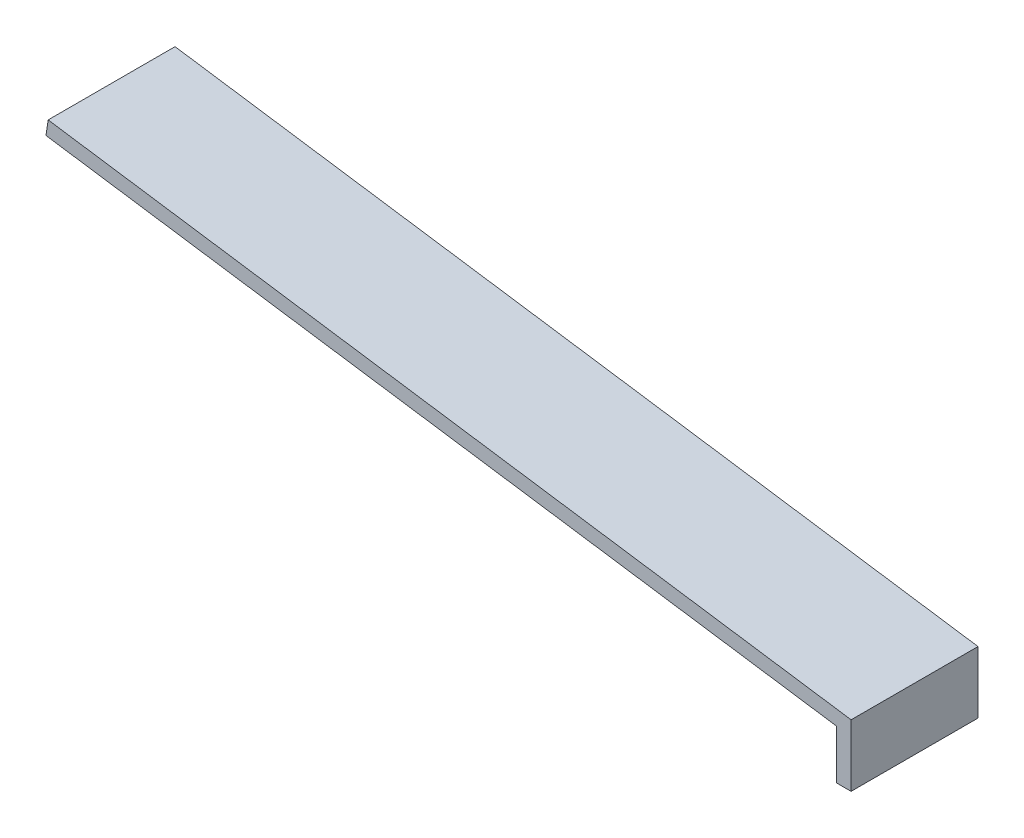
ISO-10303-21;
HEADER;
FILE_DESCRIPTION(('STEP AP214'),'2;1');
FILE_NAME('part.step','',(''),(''),'','','');
FILE_SCHEMA(('AUTOMOTIVE_DESIGN { 1 0 10303 214 1 1 1 1 }'));
ENDSEC;
DATA;
#1=APPLICATION_CONTEXT('core data for automotive mechanical design processes');
#2=APPLICATION_PROTOCOL_DEFINITION('international standard','automotive_design',2000,#1);
#3=PRODUCT_CONTEXT('',#1,'mechanical');
#4=PRODUCT('Part','Part','',(#3));
#5=PRODUCT_RELATED_PRODUCT_CATEGORY('part','',(#4));
#6=PRODUCT_DEFINITION_FORMATION('','',#4);
#7=PRODUCT_DEFINITION_CONTEXT('part definition',#1,'design');
#8=PRODUCT_DEFINITION('design','',#6,#7);
#9=PRODUCT_DEFINITION_SHAPE('','',#8);
#10=(LENGTH_UNIT() NAMED_UNIT(*) SI_UNIT(.MILLI.,.METRE.));
#11=(NAMED_UNIT(*) PLANE_ANGLE_UNIT() SI_UNIT($,.RADIAN.));
#12=(NAMED_UNIT(*) SI_UNIT($,.STERADIAN.) SOLID_ANGLE_UNIT());
#13=UNCERTAINTY_MEASURE_WITH_UNIT(LENGTH_MEASURE(1.E-05),#10,'distance_accuracy_value','');
#14=(GEOMETRIC_REPRESENTATION_CONTEXT(3) GLOBAL_UNCERTAINTY_ASSIGNED_CONTEXT((#13)) GLOBAL_UNIT_ASSIGNED_CONTEXT((#10,
#11,#12)) REPRESENTATION_CONTEXT('',''));
#15=CARTESIAN_POINT('',(0.,0.,0.));
#16=DIRECTION('',(0.,0.,1.));
#17=DIRECTION('',(1.,0.,0.));
#18=AXIS2_PLACEMENT_3D('',#15,#16,#17);
#19=CARTESIAN_POINT('',(0.5,0.,2.15));
#20=DIRECTION('',(-1.,0.,0.));
#21=DIRECTION('',(0.,-1.,0.));
#22=AXIS2_PLACEMENT_3D('',#19,#20,#21);
#23=PLANE('',#22);
#24=DIRECTION('',(0.,1.,0.));
#25=VECTOR('',#24,1.);
#26=CARTESIAN_POINT('',(0.5,0.,-2.15));
#27=LINE('',#26,#25);
#28=CARTESIAN_POINT('',(0.5,0.,-2.15));
#29=VERTEX_POINT('',#28);
#30=CARTESIAN_POINT('',(0.5,2.1,-2.15));
#31=VERTEX_POINT('',#30);
#32=EDGE_CURVE('E73',#29,#31,#27,.T.);
#33=ORIENTED_EDGE('',*,*,#32,.T.);
#34=DIRECTION('',(0.,0.,-1.));
#35=VECTOR('',#34,1.);
#36=CARTESIAN_POINT('',(0.5,2.1,2.15));
#37=LINE('',#36,#35);
#38=CARTESIAN_POINT('',(0.5,2.1,2.15));
#39=VERTEX_POINT('',#38);
#40=EDGE_CURVE('E11',#39,#31,#37,.T.);
#41=ORIENTED_EDGE('',*,*,#40,.F.);
#42=DIRECTION('',(0.,1.,0.));
#43=VECTOR('',#42,1.);
#44=CARTESIAN_POINT('',(0.5,0.,2.15));
#45=LINE('',#44,#43);
#46=CARTESIAN_POINT('',(0.5,0.,2.15));
#47=VERTEX_POINT('',#46);
#48=EDGE_CURVE('E96',#47,#39,#45,.T.);
#49=ORIENTED_EDGE('',*,*,#48,.F.);
#50=DIRECTION('',(0.,0.,-1.));
#51=VECTOR('',#50,1.);
#52=CARTESIAN_POINT('',(0.5,0.,2.15));
#53=LINE('',#52,#51);
#54=EDGE_CURVE('E86',#47,#29,#53,.T.);
#55=ORIENTED_EDGE('',*,*,#54,.T.);
#56=EDGE_LOOP('',(#33,#41,#49,#55));
#57=FACE_BOUND('',#56,.T.);
#58=ADVANCED_FACE('F17',(#57),#23,.F.);
#59=CARTESIAN_POINT('',(0.5,2.1,2.15));
#60=DIRECTION('',(-0.145454545454545,-0.989364935302748,0.));
#61=DIRECTION('',(0.989364935302748,-0.145454545454545,0.));
#62=AXIS2_PLACEMENT_3D('',#59,#60,#61);
#63=PLANE('',#62);
#64=DIRECTION('',(-0.989364935302748,0.145454545454545,0.));
#65=VECTOR('',#64,1.);
#66=CARTESIAN_POINT('',(0.5,2.1,-2.15));
#67=LINE('',#66,#65);
#68=CARTESIAN_POINT('',(-26.7075357208256,6.1,-2.15));
#69=VERTEX_POINT('',#68);
#70=EDGE_CURVE('E69',#31,#69,#67,.T.);
#71=ORIENTED_EDGE('',*,*,#70,.T.);
#72=DIRECTION('',(0.,0.,-1.));
#73=VECTOR('',#72,1.);
#74=CARTESIAN_POINT('',(-26.7075357208256,6.1,2.15));
#75=LINE('',#74,#73);
#76=CARTESIAN_POINT('',(-26.7075357208256,6.1,2.15));
#77=VERTEX_POINT('',#76);
#78=EDGE_CURVE('E24',#77,#69,#75,.T.);
#79=ORIENTED_EDGE('',*,*,#78,.F.);
#80=DIRECTION('',(-0.989364935302748,0.145454545454545,0.));
#81=VECTOR('',#80,1.);
#82=CARTESIAN_POINT('',(0.5,2.1,2.15));
#83=LINE('',#82,#81);
#84=EDGE_CURVE('E82',#39,#77,#83,.T.);
#85=ORIENTED_EDGE('',*,*,#84,.F.);
#86=ORIENTED_EDGE('',*,*,#40,.T.);
#87=EDGE_LOOP('',(#71,#79,#85,#86));
#88=FACE_BOUND('',#87,.T.);
#89=ADVANCED_FACE('F81',(#88),#63,.F.);
#90=CARTESIAN_POINT('',(-26.7075357208256,6.1,2.15));
#91=DIRECTION('',(0.989364935302748,-0.145454545454546,0.));
#92=DIRECTION('',(0.145454545454546,0.989364935302748,0.));
#93=AXIS2_PLACEMENT_3D('',#90,#91,#92);
#94=PLANE('',#93);
#95=DIRECTION('',(-0.145454545454546,-0.989364935302748,0.));
#96=VECTOR('',#95,1.);
#97=CARTESIAN_POINT('',(-26.7075357208256,6.1,-2.15));
#98=LINE('',#97,#96);
#99=CARTESIAN_POINT('',(-26.7802629935528,5.60531753234863,-2.15));
#100=VERTEX_POINT('',#99);
#101=EDGE_CURVE('E75',#69,#100,#98,.T.);
#102=ORIENTED_EDGE('',*,*,#101,.T.);
#103=DIRECTION('',(0.,0.,-1.));
#104=VECTOR('',#103,1.);
#105=CARTESIAN_POINT('',(-26.7802629935528,5.60531753234863,2.15));
#106=LINE('',#105,#104);
#107=CARTESIAN_POINT('',(-26.7802629935528,5.60531753234863,2.15));
#108=VERTEX_POINT('',#107);
#109=EDGE_CURVE('E112',#108,#100,#106,.T.);
#110=ORIENTED_EDGE('',*,*,#109,.F.);
#111=DIRECTION('',(-0.145454545454546,-0.989364935302748,0.));
#112=VECTOR('',#111,1.);
#113=CARTESIAN_POINT('',(-26.7075357208256,6.1,2.15));
#114=LINE('',#113,#112);
#115=EDGE_CURVE('E99',#77,#108,#114,.T.);
#116=ORIENTED_EDGE('',*,*,#115,.F.);
#117=ORIENTED_EDGE('',*,*,#78,.T.);
#118=EDGE_LOOP('',(#102,#110,#116,#117));
#119=FACE_BOUND('',#118,.T.);
#120=ADVANCED_FACE('F116',(#119),#94,.F.);
#121=CARTESIAN_POINT('',(-26.7802629935528,5.60531753234863,2.15));
#122=DIRECTION('',(0.145454545454545,0.989364935302748,0.));
#123=DIRECTION('',(-0.989364935302748,0.145454545454545,0.));
#124=AXIS2_PLACEMENT_3D('',#121,#122,#123);
#125=PLANE('',#124);
#126=DIRECTION('',(0.989364935302748,-0.145454545454545,0.));
#127=VECTOR('',#126,1.);
#128=CARTESIAN_POINT('',(-26.7802629935528,5.60531753234863,-2.15));
#129=LINE('',#128,#127);
#130=CARTESIAN_POINT('',(0.,1.66813435363769,-2.15));
#131=VERTEX_POINT('',#130);
#132=EDGE_CURVE('E90',#100,#131,#129,.T.);
#133=ORIENTED_EDGE('',*,*,#132,.T.);
#134=DIRECTION('',(0.,0.,-1.));
#135=VECTOR('',#134,1.);
#136=CARTESIAN_POINT('',(0.,1.66813435363769,2.15));
#137=LINE('',#136,#135);
#138=CARTESIAN_POINT('',(0.,1.66813435363769,2.15));
#139=VERTEX_POINT('',#138);
#140=EDGE_CURVE('E109',#139,#131,#137,.T.);
#141=ORIENTED_EDGE('',*,*,#140,.F.);
#142=DIRECTION('',(0.989364935302748,-0.145454545454545,0.));
#143=VECTOR('',#142,1.);
#144=CARTESIAN_POINT('',(-26.7802629935528,5.60531753234863,2.15));
#145=LINE('',#144,#143);
#146=EDGE_CURVE('E101',#108,#139,#145,.T.);
#147=ORIENTED_EDGE('',*,*,#146,.F.);
#148=ORIENTED_EDGE('',*,*,#109,.T.);
#149=EDGE_LOOP('',(#133,#141,#147,#148));
#150=FACE_BOUND('',#149,.T.);
#151=ADVANCED_FACE('F122',(#150),#125,.F.);
#152=CARTESIAN_POINT('',(0.,1.66813435363769,2.15));
#153=DIRECTION('',(1.,0.,0.));
#154=DIRECTION('',(0.,1.,0.));
#155=AXIS2_PLACEMENT_3D('',#152,#153,#154);
#156=PLANE('',#155);
#157=DIRECTION('',(0.,-1.,0.));
#158=VECTOR('',#157,1.);
#159=CARTESIAN_POINT('',(0.,1.66813435363769,-2.15));
#160=LINE('',#159,#158);
#161=CARTESIAN_POINT('',(0.,0.,-2.15));
#162=VERTEX_POINT('',#161);
#163=EDGE_CURVE('E92',#131,#162,#160,.T.);
#164=ORIENTED_EDGE('',*,*,#163,.T.);
#165=DIRECTION('',(0.,0.,-1.));
#166=VECTOR('',#165,1.);
#167=CARTESIAN_POINT('',(0.,0.,2.15));
#168=LINE('',#167,#166);
#169=CARTESIAN_POINT('',(0.,0.,2.15));
#170=VERTEX_POINT('',#169);
#171=EDGE_CURVE('E106',#170,#162,#168,.T.);
#172=ORIENTED_EDGE('',*,*,#171,.F.);
#173=DIRECTION('',(0.,-1.,0.));
#174=VECTOR('',#173,1.);
#175=CARTESIAN_POINT('',(0.,1.66813435363769,2.15));
#176=LINE('',#175,#174);
#177=EDGE_CURVE('E36',#139,#170,#176,.T.);
#178=ORIENTED_EDGE('',*,*,#177,.F.);
#179=ORIENTED_EDGE('',*,*,#140,.T.);
#180=EDGE_LOOP('',(#164,#172,#178,#179));
#181=FACE_BOUND('',#180,.T.);
#182=ADVANCED_FACE('F125',(#181),#156,.F.);
#183=CARTESIAN_POINT('',(0.,0.,2.15));
#184=DIRECTION('',(0.,1.,0.));
#185=DIRECTION('',(0.,0.,1.));
#186=AXIS2_PLACEMENT_3D('',#183,#184,#185);
#187=PLANE('',#186);
#188=DIRECTION('',(1.,0.,0.));
#189=VECTOR('',#188,1.);
#190=CARTESIAN_POINT('',(0.,0.,-2.15));
#191=LINE('',#190,#189);
#192=EDGE_CURVE('E94',#162,#29,#191,.T.);
#193=ORIENTED_EDGE('',*,*,#192,.T.);
#194=ORIENTED_EDGE('',*,*,#54,.F.);
#195=DIRECTION('',(1.,0.,0.));
#196=VECTOR('',#195,1.);
#197=CARTESIAN_POINT('',(0.,0.,2.15));
#198=LINE('',#197,#196);
#199=EDGE_CURVE('E31',#170,#47,#198,.T.);
#200=ORIENTED_EDGE('',*,*,#199,.F.);
#201=ORIENTED_EDGE('',*,*,#171,.T.);
#202=EDGE_LOOP('',(#193,#194,#200,#201));
#203=FACE_BOUND('',#202,.T.);
#204=ADVANCED_FACE('F127',(#203),#187,.F.);
#205=CARTESIAN_POINT('',(0.5,0.,2.15));
#206=DIRECTION('',(0.,0.,-1.));
#207=DIRECTION('',(-1.,0.,0.));
#208=AXIS2_PLACEMENT_3D('',#205,#206,#207);
#209=PLANE('',#208);
#210=ORIENTED_EDGE('',*,*,#48,.T.);
#211=ORIENTED_EDGE('',*,*,#84,.T.);
#212=ORIENTED_EDGE('',*,*,#115,.T.);
#213=ORIENTED_EDGE('',*,*,#146,.T.);
#214=ORIENTED_EDGE('',*,*,#177,.T.);
#215=ORIENTED_EDGE('',*,*,#199,.T.);
#216=EDGE_LOOP('',(#210,#211,#212,#213,#214,#215));
#217=FACE_BOUND('',#216,.T.);
#218=ADVANCED_FACE('F119',(#217),#209,.F.);
#219=CARTESIAN_POINT('',(0.5,0.,-2.15));
#220=DIRECTION('',(0.,0.,-1.));
#221=DIRECTION('',(-1.,0.,0.));
#222=AXIS2_PLACEMENT_3D('',#219,#220,#221);
#223=PLANE('',#222);
#224=ORIENTED_EDGE('',*,*,#32,.F.);
#225=ORIENTED_EDGE('',*,*,#192,.F.);
#226=ORIENTED_EDGE('',*,*,#163,.F.);
#227=ORIENTED_EDGE('',*,*,#132,.F.);
#228=ORIENTED_EDGE('',*,*,#101,.F.);
#229=ORIENTED_EDGE('',*,*,#70,.F.);
#230=EDGE_LOOP('',(#224,#225,#226,#227,#228,#229));
#231=FACE_BOUND('',#230,.T.);
#232=ADVANCED_FACE('F70',(#231),#223,.T.);
#233=CLOSED_SHELL('',(#58,#89,#120,#151,#182,#204,#218,#232));
#234=MANIFOLD_SOLID_BREP('B1',#233);
#235=ADVANCED_BREP_SHAPE_REPRESENTATION('',(#18,#234),#14);
#236=SHAPE_DEFINITION_REPRESENTATION(#9,#235);
ENDSEC;
END-ISO-10303-21;
